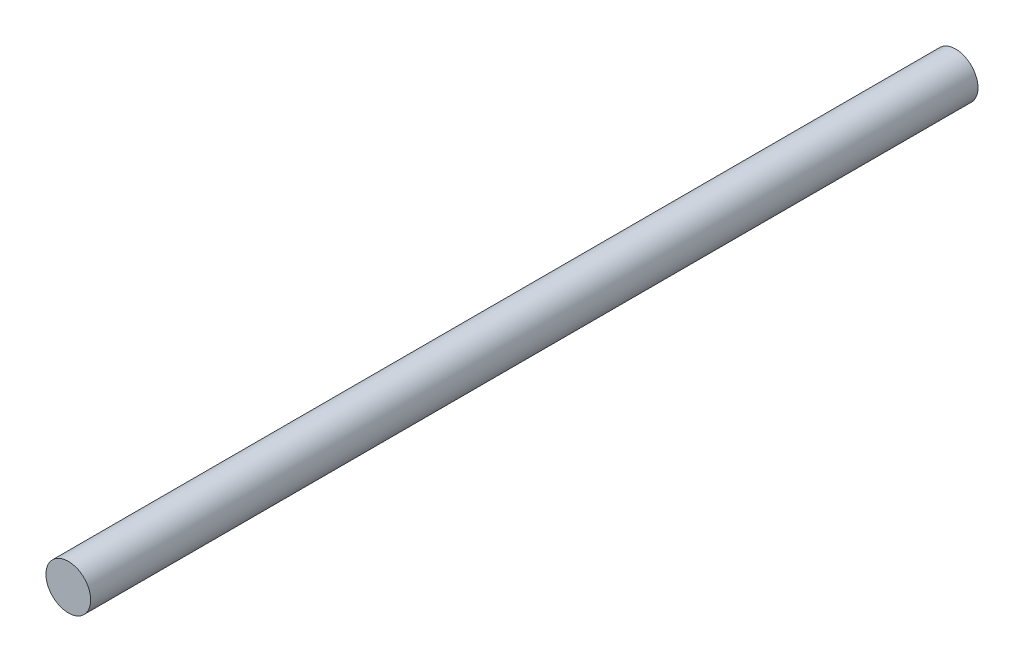
ISO-10303-21;
HEADER;
FILE_DESCRIPTION(('STEP AP214'),'2;1');
FILE_NAME('part.step','',(''),(''),'','','');
FILE_SCHEMA(('AUTOMOTIVE_DESIGN { 1 0 10303 214 1 1 1 1 }'));
ENDSEC;
DATA;
#1=APPLICATION_CONTEXT('core data for automotive mechanical design processes');
#2=APPLICATION_PROTOCOL_DEFINITION('international standard','automotive_design',2000,#1);
#3=PRODUCT_CONTEXT('',#1,'mechanical');
#4=PRODUCT('Part','Part','',(#3));
#5=PRODUCT_RELATED_PRODUCT_CATEGORY('part','',(#4));
#6=PRODUCT_DEFINITION_FORMATION('','',#4);
#7=PRODUCT_DEFINITION_CONTEXT('part definition',#1,'design');
#8=PRODUCT_DEFINITION('design','',#6,#7);
#9=PRODUCT_DEFINITION_SHAPE('','',#8);
#10=(LENGTH_UNIT() NAMED_UNIT(*) SI_UNIT(.MILLI.,.METRE.));
#11=(NAMED_UNIT(*) PLANE_ANGLE_UNIT() SI_UNIT($,.RADIAN.));
#12=(NAMED_UNIT(*) SI_UNIT($,.STERADIAN.) SOLID_ANGLE_UNIT());
#13=UNCERTAINTY_MEASURE_WITH_UNIT(LENGTH_MEASURE(1.E-05),#10,'distance_accuracy_value','');
#14=(GEOMETRIC_REPRESENTATION_CONTEXT(3) GLOBAL_UNCERTAINTY_ASSIGNED_CONTEXT((#13)) GLOBAL_UNIT_ASSIGNED_CONTEXT((#10,
#11,#12)) REPRESENTATION_CONTEXT('',''));
#15=CARTESIAN_POINT('',(0.,0.,0.));
#16=DIRECTION('',(0.,0.,1.));
#17=DIRECTION('',(1.,0.,0.));
#18=AXIS2_PLACEMENT_3D('',#15,#16,#17);
#19=CARTESIAN_POINT('',(0.,0.,126.));
#20=DIRECTION('',(0.,0.,-1.));
#21=DIRECTION('',(-1.,0.,0.));
#22=AXIS2_PLACEMENT_3D('',#19,#20,#21);
#23=CYLINDRICAL_SURFACE('',#22,3.175);
#24=CARTESIAN_POINT('',(0.,0.,126.));
#25=DIRECTION('',(0.,0.,1.));
#26=DIRECTION('',(1.,0.,0.));
#27=AXIS2_PLACEMENT_3D('',#24,#25,#26);
#28=CIRCLE('',#27,3.175);
#29=CARTESIAN_POINT('',(3.175,0.,126.));
#30=VERTEX_POINT('',#29);
#31=EDGE_CURVE('E10',#30,#30,#28,.T.);
#32=ORIENTED_EDGE('',*,*,#31,.F.);
#33=EDGE_LOOP('',(#32));
#34=FACE_BOUND('',#33,.T.);
#35=CARTESIAN_POINT('',(0.,0.,0.));
#36=DIRECTION('',(0.,0.,1.));
#37=DIRECTION('',(1.,0.,0.));
#38=AXIS2_PLACEMENT_3D('',#35,#36,#37);
#39=CIRCLE('',#38,3.175);
#40=CARTESIAN_POINT('',(3.175,0.,0.));
#41=VERTEX_POINT('',#40);
#42=EDGE_CURVE('E37',#41,#41,#39,.T.);
#43=ORIENTED_EDGE('',*,*,#42,.T.);
#44=EDGE_LOOP('',(#43));
#45=FACE_BOUND('',#44,.T.);
#46=ADVANCED_FACE('F34',(#34,#45),#23,.T.);
#47=CARTESIAN_POINT('',(0.,0.,126.));
#48=DIRECTION('',(0.,0.,1.));
#49=DIRECTION('',(1.,0.,0.));
#50=AXIS2_PLACEMENT_3D('',#47,#48,#49);
#51=PLANE('',#50);
#52=ORIENTED_EDGE('',*,*,#31,.T.);
#53=EDGE_LOOP('',(#52));
#54=FACE_BOUND('',#53,.T.);
#55=ADVANCED_FACE('F53',(#54),#51,.T.);
#56=CARTESIAN_POINT('',(0.,0.,0.));
#57=DIRECTION('',(0.,0.,1.));
#58=DIRECTION('',(1.,0.,0.));
#59=AXIS2_PLACEMENT_3D('',#56,#57,#58);
#60=PLANE('',#59);
#61=ORIENTED_EDGE('',*,*,#42,.F.);
#62=EDGE_LOOP('',(#61));
#63=FACE_BOUND('',#62,.T.);
#64=ADVANCED_FACE('F51',(#63),#60,.F.);
#65=CLOSED_SHELL('',(#46,#55,#64));
#66=MANIFOLD_SOLID_BREP('B2',#65);
#67=ADVANCED_BREP_SHAPE_REPRESENTATION('',(#18,#66),#14);
#68=SHAPE_DEFINITION_REPRESENTATION(#9,#67);
ENDSEC;
END-ISO-10303-21;
